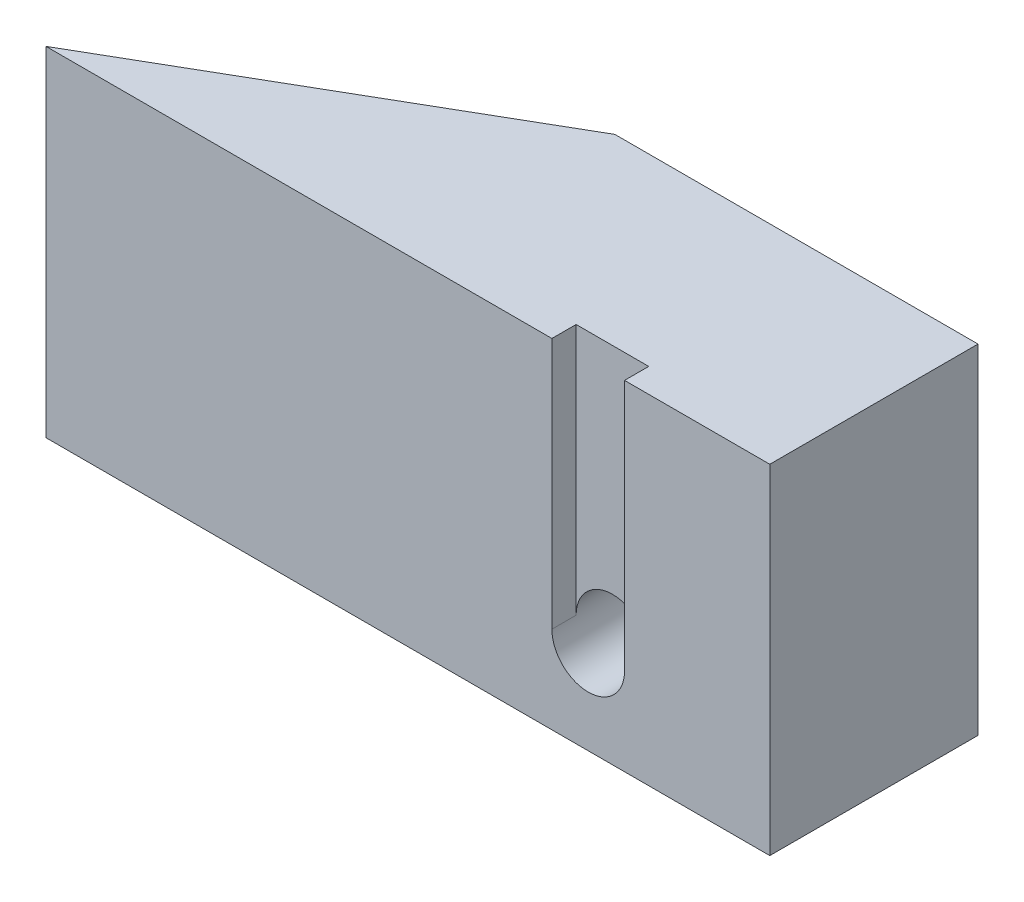
ISO-10303-21;
HEADER;
FILE_DESCRIPTION(('STEP AP214'),'2;1');
FILE_NAME('part.step','',(''),(''),'','','');
FILE_SCHEMA(('AUTOMOTIVE_DESIGN { 1 0 10303 214 1 1 1 1 }'));
ENDSEC;
DATA;
#1=APPLICATION_CONTEXT('core data for automotive mechanical design processes');
#2=APPLICATION_PROTOCOL_DEFINITION('international standard','automotive_design',2000,#1);
#3=PRODUCT_CONTEXT('',#1,'mechanical');
#4=PRODUCT('Part','Part','',(#3));
#5=PRODUCT_RELATED_PRODUCT_CATEGORY('part','',(#4));
#6=PRODUCT_DEFINITION_FORMATION('','',#4);
#7=PRODUCT_DEFINITION_CONTEXT('part definition',#1,'design');
#8=PRODUCT_DEFINITION('design','',#6,#7);
#9=PRODUCT_DEFINITION_SHAPE('','',#8);
#10=(LENGTH_UNIT() NAMED_UNIT(*) SI_UNIT(.MILLI.,.METRE.));
#11=(NAMED_UNIT(*) PLANE_ANGLE_UNIT() SI_UNIT($,.RADIAN.));
#12=(NAMED_UNIT(*) SI_UNIT($,.STERADIAN.) SOLID_ANGLE_UNIT());
#13=UNCERTAINTY_MEASURE_WITH_UNIT(LENGTH_MEASURE(1.E-05),#10,'distance_accuracy_value','');
#14=(GEOMETRIC_REPRESENTATION_CONTEXT(3) GLOBAL_UNCERTAINTY_ASSIGNED_CONTEXT((#13)) GLOBAL_UNIT_ASSIGNED_CONTEXT((#10,
#11,#12)) REPRESENTATION_CONTEXT('',''));
#15=CARTESIAN_POINT('',(0.,0.,0.));
#16=DIRECTION('',(0.,0.,1.));
#17=DIRECTION('',(1.,0.,0.));
#18=AXIS2_PLACEMENT_3D('',#15,#16,#17);
#19=CARTESIAN_POINT('',(0.,18.,-43.));
#20=DIRECTION('',(0.,0.,1.));
#21=DIRECTION('',(1.,0.,0.));
#22=AXIS2_PLACEMENT_3D('',#19,#20,#21);
#23=CYLINDRICAL_SURFACE('',#22,3.);
#24=CARTESIAN_POINT('',(0.,18.,-43.));
#25=DIRECTION('',(0.,0.,1.));
#26=DIRECTION('',(1.,0.,0.));
#27=AXIS2_PLACEMENT_3D('',#24,#25,#26);
#28=CIRCLE('',#27,3.);
#29=CARTESIAN_POINT('',(3.,18.,-43.));
#30=VERTEX_POINT('',#29);
#31=EDGE_CURVE('E158',#30,#30,#28,.T.);
#32=ORIENTED_EDGE('',*,*,#31,.F.);
#33=EDGE_LOOP('',(#32));
#34=FACE_BOUND('',#33,.T.);
#35=CARTESIAN_POINT('',(0.,18.,-30.));
#36=DIRECTION('',(0.,0.,1.));
#37=DIRECTION('',(1.,0.,0.));
#38=AXIS2_PLACEMENT_3D('',#35,#36,#37);
#39=CIRCLE('',#38,3.);
#40=CARTESIAN_POINT('',(3.,18.,-30.));
#41=VERTEX_POINT('',#40);
#42=EDGE_CURVE('E157',#41,#41,#39,.F.);
#43=ORIENTED_EDGE('',*,*,#42,.F.);
#44=EDGE_LOOP('',(#43));
#45=FACE_BOUND('',#44,.T.);
#46=ADVANCED_FACE('F39',(#34,#45),#23,.F.);
#47=CARTESIAN_POINT('',(-111.978184725462,70.,0.));
#48=DIRECTION('',(0.5,0.,0.866025403784438));
#49=DIRECTION('',(0.866025403784438,0.,-0.5));
#50=AXIS2_PLACEMENT_3D('',#47,#48,#49);
#51=PLANE('',#50);
#52=DIRECTION('',(-0.866025403784438,0.,0.5));
#53=VECTOR('',#52,1.);
#54=CARTESIAN_POINT('',(-111.978184725462,0.,0.));
#55=LINE('',#54,#53);
#56=CARTESIAN_POINT('',(-37.5,0.,-43.));
#57=VERTEX_POINT('',#56);
#58=CARTESIAN_POINT('',(-111.978184725462,0.,0.));
#59=VERTEX_POINT('',#58);
#60=EDGE_CURVE('E162',#57,#59,#55,.T.);
#61=ORIENTED_EDGE('',*,*,#60,.T.);
#62=DIRECTION('',(0.,-1.,0.));
#63=VECTOR('',#62,1.);
#64=CARTESIAN_POINT('',(-111.978184725462,70.,0.));
#65=LINE('',#64,#63);
#66=CARTESIAN_POINT('',(-111.978184725462,70.,0.));
#67=VERTEX_POINT('',#66);
#68=EDGE_CURVE('E48',#67,#59,#65,.T.);
#69=ORIENTED_EDGE('',*,*,#68,.F.);
#70=DIRECTION('',(-0.866025403784438,0.,0.5));
#71=VECTOR('',#70,1.);
#72=CARTESIAN_POINT('',(-111.978184725462,70.,0.));
#73=LINE('',#72,#71);
#74=CARTESIAN_POINT('',(-37.5,70.,-43.));
#75=VERTEX_POINT('',#74);
#76=EDGE_CURVE('E164',#75,#67,#73,.T.);
#77=ORIENTED_EDGE('',*,*,#76,.F.);
#78=DIRECTION('',(0.,-1.,0.));
#79=VECTOR('',#78,1.);
#80=CARTESIAN_POINT('',(-37.5,70.,-43.));
#81=LINE('',#80,#79);
#82=EDGE_CURVE('E175',#75,#57,#81,.T.);
#83=ORIENTED_EDGE('',*,*,#82,.T.);
#84=EDGE_LOOP('',(#61,#69,#77,#83));
#85=FACE_BOUND('',#84,.T.);
#86=ADVANCED_FACE('F41',(#85),#51,.F.);
#87=CARTESIAN_POINT('',(-111.978184725462,70.,0.));
#88=DIRECTION('',(0.,0.,-1.));
#89=DIRECTION('',(-1.,0.,0.));
#90=AXIS2_PLACEMENT_3D('',#87,#88,#89);
#91=PLANE('',#90);
#92=DIRECTION('',(1.,0.,0.));
#93=VECTOR('',#92,1.);
#94=CARTESIAN_POINT('',(-111.978184725462,70.,0.));
#95=LINE('',#94,#93);
#96=CARTESIAN_POINT('',(7.50000000000001,70.,0.));
#97=VERTEX_POINT('',#96);
#98=CARTESIAN_POINT('',(37.5,70.,0.));
#99=VERTEX_POINT('',#98);
#100=EDGE_CURVE('E167',#97,#99,#95,.T.);
#101=ORIENTED_EDGE('',*,*,#100,.F.);
#102=DIRECTION('',(0.,1.,0.));
#103=VECTOR('',#102,1.);
#104=CARTESIAN_POINT('',(7.50000000000001,70.,0.));
#105=LINE('',#104,#103);
#106=CARTESIAN_POINT('',(7.5,18.,0.));
#107=VERTEX_POINT('',#106);
#108=EDGE_CURVE('E122',#107,#97,#105,.T.);
#109=ORIENTED_EDGE('',*,*,#108,.F.);
#110=CARTESIAN_POINT('',(0.,18.,0.));
#111=DIRECTION('',(0.,0.,-1.));
#112=DIRECTION('',(-1.,0.,0.));
#113=AXIS2_PLACEMENT_3D('',#110,#111,#112);
#114=CIRCLE('',#113,7.5);
#115=CARTESIAN_POINT('',(-7.5,18.,0.));
#116=VERTEX_POINT('',#115);
#117=EDGE_CURVE('E163',#116,#107,#114,.F.);
#118=ORIENTED_EDGE('',*,*,#117,.F.);
#119=DIRECTION('',(0.,-1.,0.));
#120=VECTOR('',#119,1.);
#121=CARTESIAN_POINT('',(-7.50000000000001,70.,0.));
#122=LINE('',#121,#120);
#123=CARTESIAN_POINT('',(-7.50000000000001,70.,0.));
#124=VERTEX_POINT('',#123);
#125=EDGE_CURVE('E132',#124,#116,#122,.T.);
#126=ORIENTED_EDGE('',*,*,#125,.F.);
#127=EDGE_CURVE('E93',#67,#124,#95,.T.);
#128=ORIENTED_EDGE('',*,*,#127,.F.);
#129=ORIENTED_EDGE('',*,*,#68,.T.);
#130=DIRECTION('',(1.,0.,0.));
#131=VECTOR('',#130,1.);
#132=CARTESIAN_POINT('',(-111.978184725462,0.,0.));
#133=LINE('',#132,#131);
#134=CARTESIAN_POINT('',(37.5,0.,0.));
#135=VERTEX_POINT('',#134);
#136=EDGE_CURVE('E179',#59,#135,#133,.T.);
#137=ORIENTED_EDGE('',*,*,#136,.T.);
#138=DIRECTION('',(0.,-1.,0.));
#139=VECTOR('',#138,1.);
#140=CARTESIAN_POINT('',(37.5,70.,0.));
#141=LINE('',#140,#139);
#142=EDGE_CURVE('E192',#99,#135,#141,.T.);
#143=ORIENTED_EDGE('',*,*,#142,.F.);
#144=EDGE_LOOP('',(#101,#109,#118,#126,#128,#129,#137,#143));
#145=FACE_BOUND('',#144,.T.);
#146=ADVANCED_FACE('F206',(#145),#91,.F.);
#147=CARTESIAN_POINT('',(37.5,70.,-43.));
#148=DIRECTION('',(-1.,0.,0.));
#149=DIRECTION('',(0.,0.,1.));
#150=AXIS2_PLACEMENT_3D('',#147,#148,#149);
#151=PLANE('',#150);
#152=DIRECTION('',(0.,0.,-1.));
#153=VECTOR('',#152,1.);
#154=CARTESIAN_POINT('',(37.5,0.,-43.));
#155=LINE('',#154,#153);
#156=CARTESIAN_POINT('',(37.5,0.,-43.));
#157=VERTEX_POINT('',#156);
#158=EDGE_CURVE('E182',#135,#157,#155,.T.);
#159=ORIENTED_EDGE('',*,*,#158,.T.);
#160=DIRECTION('',(0.,-1.,0.));
#161=VECTOR('',#160,1.);
#162=CARTESIAN_POINT('',(37.5,70.,-43.));
#163=LINE('',#162,#161);
#164=CARTESIAN_POINT('',(37.5,70.,-43.));
#165=VERTEX_POINT('',#164);
#166=EDGE_CURVE('E189',#165,#157,#163,.T.);
#167=ORIENTED_EDGE('',*,*,#166,.F.);
#168=DIRECTION('',(0.,0.,-1.));
#169=VECTOR('',#168,1.);
#170=CARTESIAN_POINT('',(37.5,70.,-43.));
#171=LINE('',#170,#169);
#172=EDGE_CURVE('E170',#99,#165,#171,.T.);
#173=ORIENTED_EDGE('',*,*,#172,.F.);
#174=ORIENTED_EDGE('',*,*,#142,.T.);
#175=EDGE_LOOP('',(#159,#167,#173,#174));
#176=FACE_BOUND('',#175,.T.);
#177=ADVANCED_FACE('F212',(#176),#151,.F.);
#178=CARTESIAN_POINT('',(-37.5,70.,-43.));
#179=DIRECTION('',(0.,0.,1.));
#180=DIRECTION('',(1.,0.,0.));
#181=AXIS2_PLACEMENT_3D('',#178,#179,#180);
#182=PLANE('',#181);
#183=ORIENTED_EDGE('',*,*,#31,.T.);
#184=EDGE_LOOP('',(#183));
#185=FACE_BOUND('',#184,.T.);
#186=DIRECTION('',(-1.,0.,0.));
#187=VECTOR('',#186,1.);
#188=CARTESIAN_POINT('',(-37.5,0.,-43.));
#189=LINE('',#188,#187);
#190=EDGE_CURVE('E85',#157,#57,#189,.T.);
#191=ORIENTED_EDGE('',*,*,#190,.T.);
#192=ORIENTED_EDGE('',*,*,#82,.F.);
#193=DIRECTION('',(-1.,0.,0.));
#194=VECTOR('',#193,1.);
#195=CARTESIAN_POINT('',(-37.5,70.,-43.));
#196=LINE('',#195,#194);
#197=EDGE_CURVE('E64',#165,#75,#196,.T.);
#198=ORIENTED_EDGE('',*,*,#197,.F.);
#199=ORIENTED_EDGE('',*,*,#166,.T.);
#200=EDGE_LOOP('',(#191,#192,#198,#199));
#201=FACE_BOUND('',#200,.T.);
#202=ADVANCED_FACE('F214',(#185,#201),#182,.F.);
#203=CARTESIAN_POINT('',(0.,70.,0.));
#204=DIRECTION('',(0.,-1.,0.));
#205=DIRECTION('',(0.,0.,-1.));
#206=AXIS2_PLACEMENT_3D('',#203,#204,#205);
#207=PLANE('',#206);
#208=DIRECTION('',(-1.,0.,0.));
#209=VECTOR('',#208,1.);
#210=CARTESIAN_POINT('',(-7.50000000000001,70.,-5.));
#211=LINE('',#210,#209);
#212=CARTESIAN_POINT('',(7.50000000000001,70.,-5.));
#213=VERTEX_POINT('',#212);
#214=CARTESIAN_POINT('',(-7.50000000000001,70.,-5.));
#215=VERTEX_POINT('',#214);
#216=EDGE_CURVE('E129',#213,#215,#211,.T.);
#217=ORIENTED_EDGE('',*,*,#216,.F.);
#218=DIRECTION('',(0.,0.,1.));
#219=VECTOR('',#218,1.);
#220=CARTESIAN_POINT('',(7.50000000000001,70.,-5.));
#221=LINE('',#220,#219);
#222=EDGE_CURVE('E116',#213,#97,#221,.T.);
#223=ORIENTED_EDGE('',*,*,#222,.T.);
#224=ORIENTED_EDGE('',*,*,#100,.T.);
#225=ORIENTED_EDGE('',*,*,#172,.T.);
#226=ORIENTED_EDGE('',*,*,#197,.T.);
#227=ORIENTED_EDGE('',*,*,#76,.T.);
#228=ORIENTED_EDGE('',*,*,#127,.T.);
#229=DIRECTION('',(0.,0.,1.));
#230=VECTOR('',#229,1.);
#231=CARTESIAN_POINT('',(-7.50000000000001,70.,-5.));
#232=LINE('',#231,#230);
#233=EDGE_CURVE('E126',#215,#124,#232,.T.);
#234=ORIENTED_EDGE('',*,*,#233,.F.);
#235=EDGE_LOOP('',(#217,#223,#224,#225,#226,#227,#228,#234));
#236=FACE_BOUND('',#235,.T.);
#237=ADVANCED_FACE('F134',(#236),#207,.F.);
#238=CARTESIAN_POINT('',(0.,0.,0.));
#239=DIRECTION('',(0.,-1.,0.));
#240=DIRECTION('',(0.,0.,-1.));
#241=AXIS2_PLACEMENT_3D('',#238,#239,#240);
#242=PLANE('',#241);
#243=ORIENTED_EDGE('',*,*,#60,.F.);
#244=ORIENTED_EDGE('',*,*,#190,.F.);
#245=ORIENTED_EDGE('',*,*,#158,.F.);
#246=ORIENTED_EDGE('',*,*,#136,.F.);
#247=EDGE_LOOP('',(#243,#244,#245,#246));
#248=FACE_BOUND('',#247,.T.);
#249=ADVANCED_FACE('F220',(#248),#242,.T.);
#250=CARTESIAN_POINT('',(0.,18.,1.2E-05));
#251=DIRECTION('',(0.,0.,-1.));
#252=DIRECTION('',(-1.,0.,0.));
#253=AXIS2_PLACEMENT_3D('',#250,#251,#252);
#254=CYLINDRICAL_SURFACE('',#253,7.5);
#255=DIRECTION('',(0.,0.,1.));
#256=VECTOR('',#255,1.);
#257=CARTESIAN_POINT('',(7.5,18.,-5.));
#258=LINE('',#257,#256);
#259=CARTESIAN_POINT('',(7.5,18.,-5.));
#260=VERTEX_POINT('',#259);
#261=EDGE_CURVE('E144',#260,#107,#258,.T.);
#262=ORIENTED_EDGE('',*,*,#261,.F.);
#263=CARTESIAN_POINT('',(0.,18.,-5.));
#264=DIRECTION('',(0.,0.,1.));
#265=DIRECTION('',(1.,0.,0.));
#266=AXIS2_PLACEMENT_3D('',#263,#264,#265);
#267=CIRCLE('',#266,7.5);
#268=CARTESIAN_POINT('',(-7.5,18.,-5.));
#269=VERTEX_POINT('',#268);
#270=EDGE_CURVE('E11',#260,#269,#267,.T.);
#271=ORIENTED_EDGE('',*,*,#270,.T.);
#272=DIRECTION('',(0.,0.,1.));
#273=VECTOR('',#272,1.);
#274=CARTESIAN_POINT('',(-7.5,18.,-5.));
#275=LINE('',#274,#273);
#276=EDGE_CURVE('E148',#269,#116,#275,.T.);
#277=ORIENTED_EDGE('',*,*,#276,.T.);
#278=ORIENTED_EDGE('',*,*,#117,.T.);
#279=EDGE_LOOP('',(#262,#271,#277,#278));
#280=FACE_BOUND('',#279,.T.);
#281=CARTESIAN_POINT('',(0.,18.,-30.));
#282=DIRECTION('',(0.,0.,1.));
#283=DIRECTION('',(1.,0.,0.));
#284=AXIS2_PLACEMENT_3D('',#281,#282,#283);
#285=CIRCLE('',#284,7.5);
#286=CARTESIAN_POINT('',(7.5,18.,-30.));
#287=VERTEX_POINT('',#286);
#288=EDGE_CURVE('E147',#287,#287,#285,.T.);
#289=ORIENTED_EDGE('',*,*,#288,.F.);
#290=EDGE_LOOP('',(#289));
#291=FACE_BOUND('',#290,.T.);
#292=ADVANCED_FACE('F204',(#280,#291),#254,.F.);
#293=CARTESIAN_POINT('',(0.,18.,-30.));
#294=DIRECTION('',(0.,0.,1.));
#295=DIRECTION('',(1.,0.,0.));
#296=AXIS2_PLACEMENT_3D('',#293,#294,#295);
#297=PLANE('',#296);
#298=ORIENTED_EDGE('',*,*,#288,.T.);
#299=EDGE_LOOP('',(#298));
#300=FACE_BOUND('',#299,.T.);
#301=ORIENTED_EDGE('',*,*,#42,.T.);
#302=EDGE_LOOP('',(#301));
#303=FACE_BOUND('',#302,.T.);
#304=ADVANCED_FACE('F227',(#300,#303),#297,.T.);
#305=CARTESIAN_POINT('',(7.50000000000001,70.,-5.));
#306=DIRECTION('',(1.,0.,0.));
#307=DIRECTION('',(0.,1.,0.));
#308=AXIS2_PLACEMENT_3D('',#305,#306,#307);
#309=PLANE('',#308);
#310=ORIENTED_EDGE('',*,*,#108,.T.);
#311=ORIENTED_EDGE('',*,*,#222,.F.);
#312=DIRECTION('',(0.,1.,0.));
#313=VECTOR('',#312,1.);
#314=CARTESIAN_POINT('',(7.50000000000001,70.,-5.));
#315=LINE('',#314,#313);
#316=EDGE_CURVE('E119',#260,#213,#315,.T.);
#317=ORIENTED_EDGE('',*,*,#316,.F.);
#318=ORIENTED_EDGE('',*,*,#261,.T.);
#319=EDGE_LOOP('',(#310,#311,#317,#318));
#320=FACE_BOUND('',#319,.T.);
#321=ADVANCED_FACE('F118',(#320),#309,.F.);
#322=CARTESIAN_POINT('',(-7.50000000000001,70.,-5.));
#323=DIRECTION('',(-1.,0.,0.));
#324=DIRECTION('',(0.,-1.,0.));
#325=AXIS2_PLACEMENT_3D('',#322,#323,#324);
#326=PLANE('',#325);
#327=ORIENTED_EDGE('',*,*,#125,.T.);
#328=ORIENTED_EDGE('',*,*,#276,.F.);
#329=DIRECTION('',(0.,-1.,0.));
#330=VECTOR('',#329,1.);
#331=CARTESIAN_POINT('',(-7.50000000000001,70.,-5.));
#332=LINE('',#331,#330);
#333=EDGE_CURVE('E55',#215,#269,#332,.T.);
#334=ORIENTED_EDGE('',*,*,#333,.F.);
#335=ORIENTED_EDGE('',*,*,#233,.T.);
#336=EDGE_LOOP('',(#327,#328,#334,#335));
#337=FACE_BOUND('',#336,.T.);
#338=ADVANCED_FACE('F245',(#337),#326,.F.);
#339=CARTESIAN_POINT('',(0.,0.,-5.));
#340=DIRECTION('',(0.,0.,1.));
#341=DIRECTION('',(1.,0.,0.));
#342=AXIS2_PLACEMENT_3D('',#339,#340,#341);
#343=PLANE('',#342);
#344=ORIENTED_EDGE('',*,*,#316,.T.);
#345=ORIENTED_EDGE('',*,*,#216,.T.);
#346=ORIENTED_EDGE('',*,*,#333,.T.);
#347=ORIENTED_EDGE('',*,*,#270,.F.);
#348=EDGE_LOOP('',(#344,#345,#346,#347));
#349=FACE_BOUND('',#348,.T.);
#350=ADVANCED_FACE('F128',(#349),#343,.T.);
#351=CLOSED_SHELL('',(#46,#86,#146,#177,#202,#237,#249,#292,#304,#321,#338,#350));
#352=MANIFOLD_SOLID_BREP('B2',#351);
#353=ADVANCED_BREP_SHAPE_REPRESENTATION('',(#18,#352),#14);
#354=SHAPE_DEFINITION_REPRESENTATION(#9,#353);
ENDSEC;
END-ISO-10303-21;
